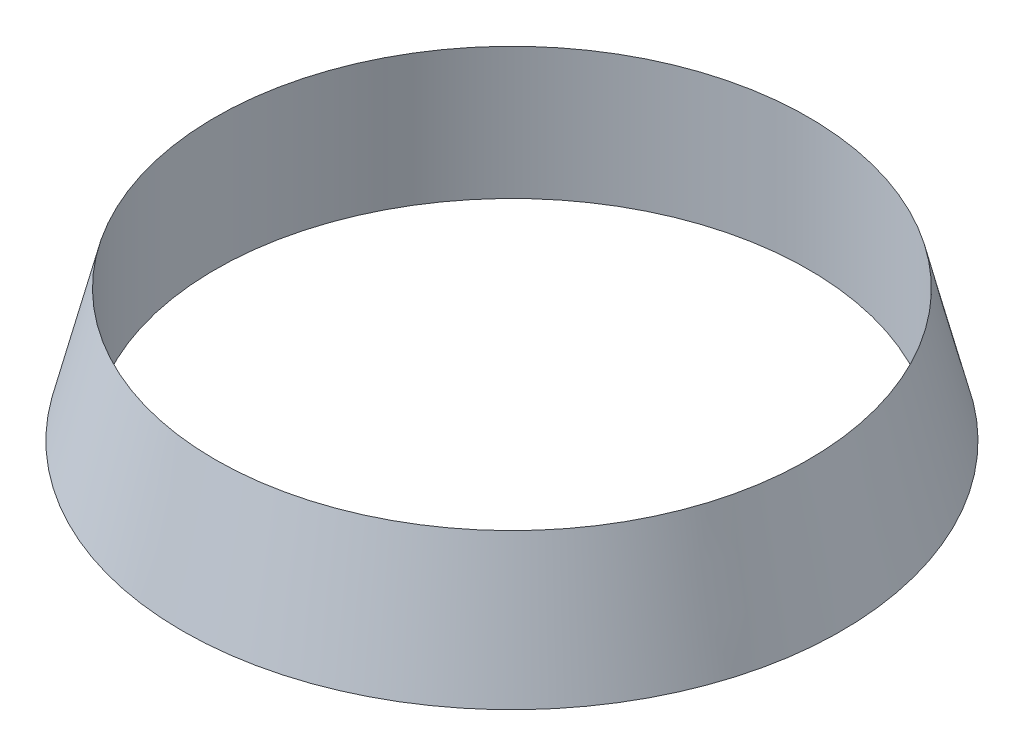
ISO-10303-21;
HEADER;
FILE_DESCRIPTION(('STEP AP214'),'2;1');
FILE_NAME('part.step','',(''),(''),'','','');
FILE_SCHEMA(('AUTOMOTIVE_DESIGN { 1 0 10303 214 1 1 1 1 }'));
ENDSEC;
DATA;
#1=APPLICATION_CONTEXT('core data for automotive mechanical design processes');
#2=APPLICATION_PROTOCOL_DEFINITION('international standard','automotive_design',2000,#1);
#3=PRODUCT_CONTEXT('',#1,'mechanical');
#4=PRODUCT('Part','Part','',(#3));
#5=PRODUCT_RELATED_PRODUCT_CATEGORY('part','',(#4));
#6=PRODUCT_DEFINITION_FORMATION('','',#4);
#7=PRODUCT_DEFINITION_CONTEXT('part definition',#1,'design');
#8=PRODUCT_DEFINITION('design','',#6,#7);
#9=PRODUCT_DEFINITION_SHAPE('','',#8);
#10=(LENGTH_UNIT() NAMED_UNIT(*) SI_UNIT(.MILLI.,.METRE.));
#11=(NAMED_UNIT(*) PLANE_ANGLE_UNIT() SI_UNIT($,.RADIAN.));
#12=(NAMED_UNIT(*) SI_UNIT($,.STERADIAN.) SOLID_ANGLE_UNIT());
#13=UNCERTAINTY_MEASURE_WITH_UNIT(LENGTH_MEASURE(1.E-05),#10,'distance_accuracy_value','');
#14=(GEOMETRIC_REPRESENTATION_CONTEXT(3) GLOBAL_UNCERTAINTY_ASSIGNED_CONTEXT((#13)) GLOBAL_UNIT_ASSIGNED_CONTEXT((#10,
#11,#12)) REPRESENTATION_CONTEXT('',''));
#15=CARTESIAN_POINT('',(0.,0.,0.));
#16=DIRECTION('',(0.,0.,1.));
#17=DIRECTION('',(1.,0.,0.));
#18=AXIS2_PLACEMENT_3D('',#15,#16,#17);
#19=CARTESIAN_POINT('',(0.,0.,0.));
#20=DIRECTION('',(0.,1.,0.));
#21=DIRECTION('',(0.,0.,1.));
#22=AXIS2_PLACEMENT_3D('',#19,#20,#21);
#23=PLANE('',#22);
#24=CARTESIAN_POINT('',(0.,0.,0.));
#25=DIRECTION('',(0.,1.,0.));
#26=DIRECTION('',(0.,0.,1.));
#27=AXIS2_PLACEMENT_3D('',#24,#25,#26);
#28=CIRCLE('',#27,45.);
#29=CARTESIAN_POINT('',(0.,0.,45.));
#30=VERTEX_POINT('',#29);
#31=EDGE_CURVE('E50',#30,#30,#28,.T.);
#32=ORIENTED_EDGE('',*,*,#31,.T.);
#33=EDGE_LOOP('',(#32));
#34=FACE_BOUND('',#33,.T.);
#35=CARTESIAN_POINT('',(0.,0.,0.));
#36=DIRECTION('',(0.,1.,0.));
#37=DIRECTION('',(0.,0.,1.));
#38=AXIS2_PLACEMENT_3D('',#35,#36,#37);
#39=CIRCLE('',#38,50.);
#40=CARTESIAN_POINT('',(0.,0.,50.));
#41=VERTEX_POINT('',#40);
#42=EDGE_CURVE('E11',#41,#41,#39,.T.);
#43=ORIENTED_EDGE('',*,*,#42,.F.);
#44=EDGE_LOOP('',(#43));
#45=FACE_BOUND('',#44,.T.);
#46=ADVANCED_FACE('F41',(#34,#45),#23,.F.);
#47=CARTESIAN_POINT('',(0.,20.,0.));
#48=DIRECTION('',(0.,-1.,0.));
#49=DIRECTION('',(0.,0.,-1.));
#50=AXIS2_PLACEMENT_3D('',#47,#48,#49);
#51=CONICAL_SURFACE('',#50,45.,0.244978663126864);
#52=ORIENTED_EDGE('',*,*,#42,.T.);
#53=EDGE_LOOP('',(#52));
#54=FACE_BOUND('',#53,.T.);
#55=CARTESIAN_POINT('',(0.,20.,0.));
#56=DIRECTION('',(0.,1.,0.));
#57=DIRECTION('',(0.,0.,1.));
#58=AXIS2_PLACEMENT_3D('',#55,#56,#57);
#59=CIRCLE('',#58,45.);
#60=CARTESIAN_POINT('',(0.,20.,45.));
#61=VERTEX_POINT('',#60);
#62=EDGE_CURVE('E56',#61,#61,#59,.T.);
#63=ORIENTED_EDGE('',*,*,#62,.F.);
#64=EDGE_LOOP('',(#63));
#65=FACE_BOUND('',#64,.T.);
#66=ADVANCED_FACE('F43',(#54,#65),#51,.T.);
#67=CARTESIAN_POINT('',(0.,-9.99999999994061E-05,0.));
#68=DIRECTION('',(0.,1.,0.));
#69=DIRECTION('',(0.,0.,1.));
#70=AXIS2_PLACEMENT_3D('',#67,#68,#69);
#71=CYLINDRICAL_SURFACE('',#70,45.);
#72=ORIENTED_EDGE('',*,*,#62,.T.);
#73=EDGE_LOOP('',(#72));
#74=FACE_BOUND('',#73,.T.);
#75=ORIENTED_EDGE('',*,*,#31,.F.);
#76=EDGE_LOOP('',(#75));
#77=FACE_BOUND('',#76,.T.);
#78=ADVANCED_FACE('F72',(#74,#77),#71,.F.);
#79=CLOSED_SHELL('',(#46,#66,#78));
#80=MANIFOLD_SOLID_BREP('B2',#79);
#81=ADVANCED_BREP_SHAPE_REPRESENTATION('',(#18,#80),#14);
#82=SHAPE_DEFINITION_REPRESENTATION(#9,#81);
ENDSEC;
END-ISO-10303-21;
